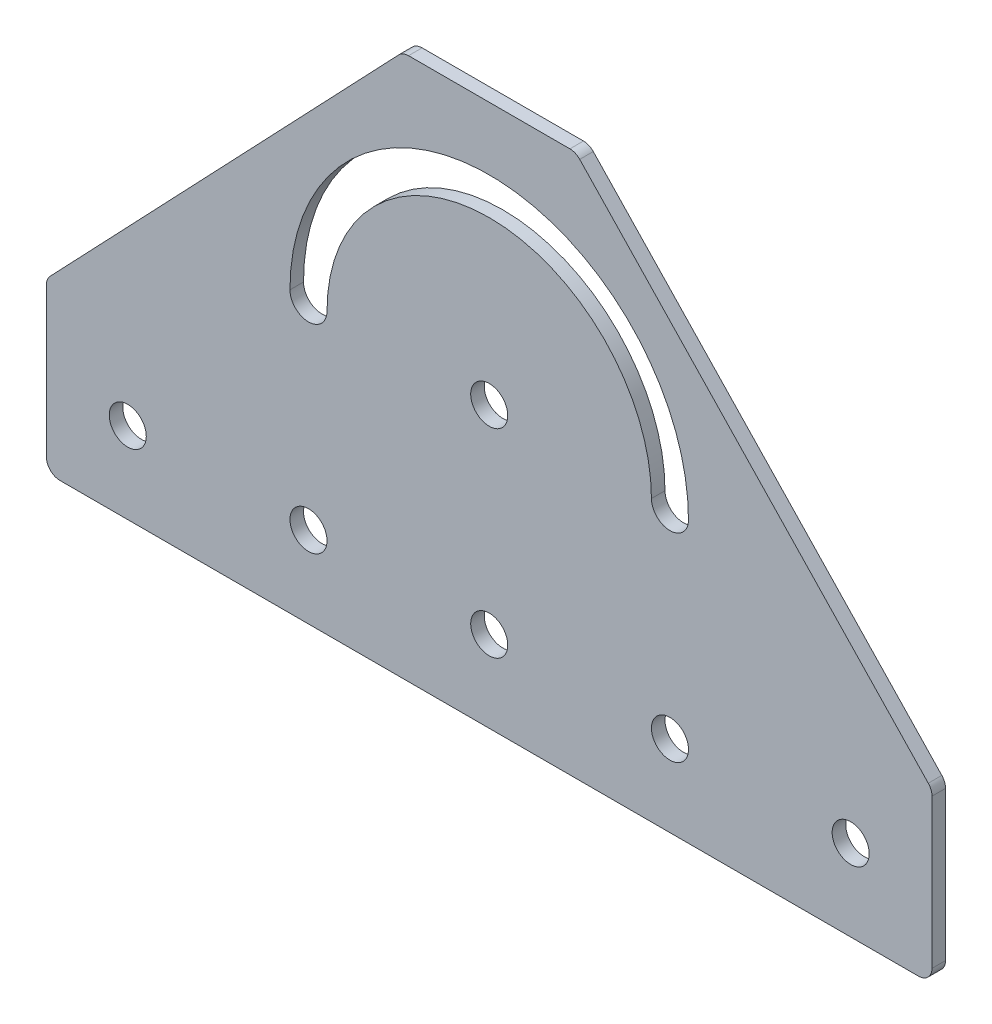
ISO-10303-21;
HEADER;
FILE_DESCRIPTION(('STEP AP214'),'2;1');
FILE_NAME('part.step','',(''),(''),'','','');
FILE_SCHEMA(('AUTOMOTIVE_DESIGN { 1 0 10303 214 1 1 1 1 }'));
ENDSEC;
DATA;
#1=APPLICATION_CONTEXT('core data for automotive mechanical design processes');
#2=APPLICATION_PROTOCOL_DEFINITION('international standard','automotive_design',2000,#1);
#3=PRODUCT_CONTEXT('',#1,'mechanical');
#4=PRODUCT('Part','Part','',(#3));
#5=PRODUCT_RELATED_PRODUCT_CATEGORY('part','',(#4));
#6=PRODUCT_DEFINITION_FORMATION('','',#4);
#7=PRODUCT_DEFINITION_CONTEXT('part definition',#1,'design');
#8=PRODUCT_DEFINITION('design','',#6,#7);
#9=PRODUCT_DEFINITION_SHAPE('','',#8);
#10=(LENGTH_UNIT() NAMED_UNIT(*) SI_UNIT(.MILLI.,.METRE.));
#11=(NAMED_UNIT(*) PLANE_ANGLE_UNIT() SI_UNIT($,.RADIAN.));
#12=(NAMED_UNIT(*) SI_UNIT($,.STERADIAN.) SOLID_ANGLE_UNIT());
#13=UNCERTAINTY_MEASURE_WITH_UNIT(LENGTH_MEASURE(1.E-05),#10,'distance_accuracy_value','');
#14=(GEOMETRIC_REPRESENTATION_CONTEXT(3) GLOBAL_UNCERTAINTY_ASSIGNED_CONTEXT((#13)) GLOBAL_UNIT_ASSIGNED_CONTEXT((#10,
#11,#12)) REPRESENTATION_CONTEXT('',''));
#15=CARTESIAN_POINT('',(0.,0.,0.));
#16=DIRECTION('',(0.,0.,1.));
#17=DIRECTION('',(1.,0.,0.));
#18=AXIS2_PLACEMENT_3D('',#15,#16,#17);
#19=CARTESIAN_POINT('',(0.,0.,3.));
#20=DIRECTION('',(0.,0.,1.));
#21=DIRECTION('',(1.,0.,0.));
#22=AXIS2_PLACEMENT_3D('',#19,#20,#21);
#23=PLANE('',#22);
#24=CARTESIAN_POINT('',(0.,63.9999999999994,3.));
#25=DIRECTION('',(0.,0.,1.));
#26=DIRECTION('',(1.,0.,0.));
#27=AXIS2_PLACEMENT_3D('',#24,#25,#26);
#28=CIRCLE('',#27,4.1);
#29=CARTESIAN_POINT('',(4.1,63.9999999999994,3.));
#30=VERTEX_POINT('',#29);
#31=EDGE_CURVE('E253',#30,#30,#28,.T.);
#32=ORIENTED_EDGE('',*,*,#31,.F.);
#33=EDGE_LOOP('',(#32));
#34=FACE_BOUND('',#33,.T.);
#35=CARTESIAN_POINT('',(-40.,19.9999999999992,3.));
#36=DIRECTION('',(0.,0.,1.));
#37=DIRECTION('',(1.,0.,0.));
#38=AXIS2_PLACEMENT_3D('',#35,#36,#37);
#39=CIRCLE('',#38,4.1);
#40=CARTESIAN_POINT('',(-35.9,19.9999999999992,3.));
#41=VERTEX_POINT('',#40);
#42=EDGE_CURVE('E267',#41,#41,#39,.T.);
#43=ORIENTED_EDGE('',*,*,#42,.F.);
#44=EDGE_LOOP('',(#43));
#45=FACE_BOUND('',#44,.T.);
#46=CARTESIAN_POINT('',(40.,19.9999999999997,3.));
#47=DIRECTION('',(0.,0.,1.));
#48=DIRECTION('',(1.,0.,0.));
#49=AXIS2_PLACEMENT_3D('',#46,#47,#48);
#50=CIRCLE('',#49,4.1);
#51=CARTESIAN_POINT('',(44.1,19.9999999999997,3.));
#52=VERTEX_POINT('',#51);
#53=EDGE_CURVE('E163',#52,#52,#50,.T.);
#54=ORIENTED_EDGE('',*,*,#53,.F.);
#55=EDGE_LOOP('',(#54));
#56=FACE_BOUND('',#55,.T.);
#57=CARTESIAN_POINT('',(80.,20.,3.));
#58=DIRECTION('',(0.,0.,1.));
#59=DIRECTION('',(1.,0.,0.));
#60=AXIS2_PLACEMENT_3D('',#57,#58,#59);
#61=CIRCLE('',#60,4.1);
#62=CARTESIAN_POINT('',(84.1,20.,3.));
#63=VERTEX_POINT('',#62);
#64=EDGE_CURVE('E174',#63,#63,#61,.T.);
#65=ORIENTED_EDGE('',*,*,#64,.F.);
#66=EDGE_LOOP('',(#65));
#67=FACE_BOUND('',#66,.T.);
#68=CARTESIAN_POINT('',(0.,63.9999999999994,3.));
#69=DIRECTION('',(0.,0.,1.));
#70=DIRECTION('',(1.,0.,0.));
#71=AXIS2_PLACEMENT_3D('',#68,#69,#70);
#72=CIRCLE('',#71,44.1);
#73=CARTESIAN_POINT('',(44.1,63.9999999999994,3.));
#74=VERTEX_POINT('',#73);
#75=CARTESIAN_POINT('',(-44.1,63.9999999999994,3.));
#76=VERTEX_POINT('',#75);
#77=EDGE_CURVE('E140',#74,#76,#72,.T.);
#78=ORIENTED_EDGE('',*,*,#77,.F.);
#79=CARTESIAN_POINT('',(40.,63.9999999999994,3.));
#80=DIRECTION('',(0.,0.,1.));
#81=DIRECTION('',(1.,0.,0.));
#82=AXIS2_PLACEMENT_3D('',#79,#80,#81);
#83=CIRCLE('',#82,4.1);
#84=CARTESIAN_POINT('',(35.9,63.9999999999994,3.));
#85=VERTEX_POINT('',#84);
#86=EDGE_CURVE('E130',#85,#74,#83,.T.);
#87=ORIENTED_EDGE('',*,*,#86,.F.);
#88=CARTESIAN_POINT('',(0.,63.9999999999994,3.));
#89=DIRECTION('',(0.,0.,-1.));
#90=DIRECTION('',(1.,0.,0.));
#91=AXIS2_PLACEMENT_3D('',#88,#89,#90);
#92=CIRCLE('',#91,35.9);
#93=CARTESIAN_POINT('',(-35.9,63.9999999999994,3.));
#94=VERTEX_POINT('',#93);
#95=EDGE_CURVE('E156',#94,#85,#92,.T.);
#96=ORIENTED_EDGE('',*,*,#95,.F.);
#97=CARTESIAN_POINT('',(-40.,63.9999999999994,3.));
#98=DIRECTION('',(0.,0.,1.));
#99=DIRECTION('',(1.,0.,0.));
#100=AXIS2_PLACEMENT_3D('',#97,#98,#99);
#101=CIRCLE('',#100,4.1);
#102=EDGE_CURVE('E154',#76,#94,#101,.T.);
#103=ORIENTED_EDGE('',*,*,#102,.F.);
#104=EDGE_LOOP('',(#78,#87,#96,#103));
#105=FACE_BOUND('',#104,.T.);
#106=CARTESIAN_POINT('',(0.,19.9999999999994,3.));
#107=DIRECTION('',(0.,0.,1.));
#108=DIRECTION('',(1.,0.,0.));
#109=AXIS2_PLACEMENT_3D('',#106,#107,#108);
#110=CIRCLE('',#109,4.1);
#111=CARTESIAN_POINT('',(4.1,19.9999999999994,3.));
#112=VERTEX_POINT('',#111);
#113=EDGE_CURVE('E273',#112,#112,#110,.T.);
#114=ORIENTED_EDGE('',*,*,#113,.F.);
#115=EDGE_LOOP('',(#114));
#116=FACE_BOUND('',#115,.T.);
#117=CARTESIAN_POINT('',(-80.,19.9999999999989,3.));
#118=DIRECTION('',(0.,0.,1.));
#119=DIRECTION('',(1.,0.,0.));
#120=AXIS2_PLACEMENT_3D('',#117,#118,#119);
#121=CIRCLE('',#120,4.1);
#122=CARTESIAN_POINT('',(-75.9,19.9999999999989,3.));
#123=VERTEX_POINT('',#122);
#124=EDGE_CURVE('E261',#123,#123,#121,.T.);
#125=ORIENTED_EDGE('',*,*,#124,.F.);
#126=EDGE_LOOP('',(#125));
#127=FACE_BOUND('',#126,.T.);
#128=DIRECTION('',(0.,1.,0.));
#129=VECTOR('',#128,1.);
#130=CARTESIAN_POINT('',(98.,2.00000000000001,3.));
#131=LINE('',#130,#129);
#132=CARTESIAN_POINT('',(98.,5.00000000000001,3.));
#133=VERTEX_POINT('',#132);
#134=CARTESIAN_POINT('',(98.,38.,3.));
#135=VERTEX_POINT('',#134);
#136=EDGE_CURVE('E243',#133,#135,#131,.T.);
#137=ORIENTED_EDGE('',*,*,#136,.T.);
#138=CARTESIAN_POINT('',(95.,38.,3.));
#139=DIRECTION('',(0.,0.,1.));
#140=DIRECTION('',(1.,0.,0.));
#141=AXIS2_PLACEMENT_3D('',#138,#139,#140);
#142=CIRCLE('',#141,3.);
#143=CARTESIAN_POINT('',(97.1724137931034,40.0689655172414,3.));
#144=VERTEX_POINT('',#143);
#145=EDGE_CURVE('E194',#135,#144,#142,.T.);
#146=ORIENTED_EDGE('',*,*,#145,.T.);
#147=DIRECTION('',(-0.689655172413796,0.72413793103448,0.));
#148=VECTOR('',#147,1.);
#149=CARTESIAN_POINT('',(98.,39.2,3.));
#150=LINE('',#149,#148);
#151=CARTESIAN_POINT('',(20.0295566502463,121.068965517241,3.));
#152=VERTEX_POINT('',#151);
#153=EDGE_CURVE('E239',#144,#152,#150,.T.);
#154=ORIENTED_EDGE('',*,*,#153,.T.);
#155=CARTESIAN_POINT('',(17.8571428571429,118.999999999999,3.));
#156=DIRECTION('',(0.,0.,1.));
#157=DIRECTION('',(1.,0.,0.));
#158=AXIS2_PLACEMENT_3D('',#155,#156,#157);
#159=CIRCLE('',#158,3.);
#160=CARTESIAN_POINT('',(17.8571428571429,121.999999999999,3.));
#161=VERTEX_POINT('',#160);
#162=EDGE_CURVE('E186',#152,#161,#159,.T.);
#163=ORIENTED_EDGE('',*,*,#162,.T.);
#164=DIRECTION('',(-1.,0.,0.));
#165=VECTOR('',#164,1.);
#166=CARTESIAN_POINT('',(19.1428571428571,121.999999999999,3.));
#167=LINE('',#166,#165);
#168=CARTESIAN_POINT('',(-17.8571428571429,121.999999999999,3.));
#169=VERTEX_POINT('',#168);
#170=EDGE_CURVE('E230',#161,#169,#167,.T.);
#171=ORIENTED_EDGE('',*,*,#170,.T.);
#172=CARTESIAN_POINT('',(-17.8571428571429,118.999999999999,3.));
#173=DIRECTION('',(0.,0.,1.));
#174=DIRECTION('',(1.,0.,0.));
#175=AXIS2_PLACEMENT_3D('',#172,#173,#174);
#176=CIRCLE('',#175,3.);
#177=CARTESIAN_POINT('',(-20.0295566502463,121.068965517241,3.));
#178=VERTEX_POINT('',#177);
#179=EDGE_CURVE('E184',#169,#178,#176,.T.);
#180=ORIENTED_EDGE('',*,*,#179,.T.);
#181=DIRECTION('',(-0.689655172413796,-0.72413793103448,0.));
#182=VECTOR('',#181,1.);
#183=CARTESIAN_POINT('',(-19.1428571428572,121.999999999999,3.));
#184=LINE('',#183,#182);
#185=CARTESIAN_POINT('',(-97.1724137931035,40.0689655172414,3.));
#186=VERTEX_POINT('',#185);
#187=EDGE_CURVE('E238',#178,#186,#184,.T.);
#188=ORIENTED_EDGE('',*,*,#187,.T.);
#189=CARTESIAN_POINT('',(-95.,38.,3.));
#190=DIRECTION('',(0.,0.,1.));
#191=DIRECTION('',(1.,0.,0.));
#192=AXIS2_PLACEMENT_3D('',#189,#190,#191);
#193=CIRCLE('',#192,3.);
#194=CARTESIAN_POINT('',(-98.,38.,3.));
#195=VERTEX_POINT('',#194);
#196=EDGE_CURVE('E188',#186,#195,#193,.T.);
#197=ORIENTED_EDGE('',*,*,#196,.T.);
#198=DIRECTION('',(0.,-1.,0.));
#199=VECTOR('',#198,1.);
#200=CARTESIAN_POINT('',(-98.,39.2,3.));
#201=LINE('',#200,#199);
#202=CARTESIAN_POINT('',(-98.,5.,3.));
#203=VERTEX_POINT('',#202);
#204=EDGE_CURVE('E241',#195,#203,#201,.T.);
#205=ORIENTED_EDGE('',*,*,#204,.T.);
#206=CARTESIAN_POINT('',(-95.,5.,3.));
#207=DIRECTION('',(0.,0.,1.));
#208=DIRECTION('',(1.,0.,0.));
#209=AXIS2_PLACEMENT_3D('',#206,#207,#208);
#210=CIRCLE('',#209,3.);
#211=CARTESIAN_POINT('',(-95.,2.,3.));
#212=VERTEX_POINT('',#211);
#213=EDGE_CURVE('E190',#203,#212,#210,.T.);
#214=ORIENTED_EDGE('',*,*,#213,.T.);
#215=DIRECTION('',(1.,0.,0.));
#216=VECTOR('',#215,1.);
#217=CARTESIAN_POINT('',(-98.,2.,3.));
#218=LINE('',#217,#216);
#219=CARTESIAN_POINT('',(95.,2.00000000000001,3.));
#220=VERTEX_POINT('',#219);
#221=EDGE_CURVE('E249',#212,#220,#218,.T.);
#222=ORIENTED_EDGE('',*,*,#221,.T.);
#223=CARTESIAN_POINT('',(95.,5.00000000000001,3.));
#224=DIRECTION('',(0.,0.,1.));
#225=DIRECTION('',(1.,0.,0.));
#226=AXIS2_PLACEMENT_3D('',#223,#224,#225);
#227=CIRCLE('',#226,3.);
#228=EDGE_CURVE('E192',#220,#133,#227,.T.);
#229=ORIENTED_EDGE('',*,*,#228,.T.);
#230=EDGE_LOOP('',(#137,#146,#154,#163,#171,#180,#188,#197,#205,#214,#222,#229));
#231=FACE_BOUND('',#230,.T.);
#232=ADVANCED_FACE('F16',(#34,#45,#56,#67,#105,#116,#127,#231),#23,.T.);
#233=CARTESIAN_POINT('',(0.,0.,0.));
#234=DIRECTION('',(0.,0.,1.));
#235=DIRECTION('',(1.,0.,0.));
#236=AXIS2_PLACEMENT_3D('',#233,#234,#235);
#237=PLANE('',#236);
#238=CARTESIAN_POINT('',(0.,63.9999999999994,0.));
#239=DIRECTION('',(0.,0.,1.));
#240=DIRECTION('',(1.,0.,0.));
#241=AXIS2_PLACEMENT_3D('',#238,#239,#240);
#242=CIRCLE('',#241,4.1);
#243=CARTESIAN_POINT('',(4.1,63.9999999999994,0.));
#244=VERTEX_POINT('',#243);
#245=EDGE_CURVE('E257',#244,#244,#242,.T.);
#246=ORIENTED_EDGE('',*,*,#245,.T.);
#247=EDGE_LOOP('',(#246));
#248=FACE_BOUND('',#247,.T.);
#249=CARTESIAN_POINT('',(-80.,19.9999999999989,0.));
#250=DIRECTION('',(0.,0.,1.));
#251=DIRECTION('',(1.,0.,0.));
#252=AXIS2_PLACEMENT_3D('',#249,#250,#251);
#253=CIRCLE('',#252,4.1);
#254=CARTESIAN_POINT('',(-75.9,19.9999999999989,0.));
#255=VERTEX_POINT('',#254);
#256=EDGE_CURVE('E256',#255,#255,#253,.T.);
#257=ORIENTED_EDGE('',*,*,#256,.T.);
#258=EDGE_LOOP('',(#257));
#259=FACE_BOUND('',#258,.T.);
#260=CARTESIAN_POINT('',(-40.,19.9999999999992,0.));
#261=DIRECTION('',(0.,0.,1.));
#262=DIRECTION('',(1.,0.,0.));
#263=AXIS2_PLACEMENT_3D('',#260,#261,#262);
#264=CIRCLE('',#263,4.1);
#265=CARTESIAN_POINT('',(-35.9,19.9999999999992,0.));
#266=VERTEX_POINT('',#265);
#267=EDGE_CURVE('E264',#266,#266,#264,.T.);
#268=ORIENTED_EDGE('',*,*,#267,.T.);
#269=EDGE_LOOP('',(#268));
#270=FACE_BOUND('',#269,.T.);
#271=CARTESIAN_POINT('',(0.,19.9999999999994,0.));
#272=DIRECTION('',(0.,0.,1.));
#273=DIRECTION('',(1.,0.,0.));
#274=AXIS2_PLACEMENT_3D('',#271,#272,#273);
#275=CIRCLE('',#274,4.1);
#276=CARTESIAN_POINT('',(4.1,19.9999999999994,0.));
#277=VERTEX_POINT('',#276);
#278=EDGE_CURVE('E270',#277,#277,#275,.T.);
#279=ORIENTED_EDGE('',*,*,#278,.T.);
#280=EDGE_LOOP('',(#279));
#281=FACE_BOUND('',#280,.T.);
#282=CARTESIAN_POINT('',(40.,19.9999999999997,0.));
#283=DIRECTION('',(0.,0.,1.));
#284=DIRECTION('',(1.,0.,0.));
#285=AXIS2_PLACEMENT_3D('',#282,#283,#284);
#286=CIRCLE('',#285,4.1);
#287=CARTESIAN_POINT('',(44.1,19.9999999999997,0.));
#288=VERTEX_POINT('',#287);
#289=EDGE_CURVE('E276',#288,#288,#286,.T.);
#290=ORIENTED_EDGE('',*,*,#289,.T.);
#291=EDGE_LOOP('',(#290));
#292=FACE_BOUND('',#291,.T.);
#293=CARTESIAN_POINT('',(40.,63.9999999999994,0.));
#294=DIRECTION('',(0.,0.,1.));
#295=DIRECTION('',(1.,0.,0.));
#296=AXIS2_PLACEMENT_3D('',#293,#294,#295);
#297=CIRCLE('',#296,4.1);
#298=CARTESIAN_POINT('',(35.9,63.9999999999994,0.));
#299=VERTEX_POINT('',#298);
#300=CARTESIAN_POINT('',(44.1,63.9999999999994,0.));
#301=VERTEX_POINT('',#300);
#302=EDGE_CURVE('E161',#299,#301,#297,.T.);
#303=ORIENTED_EDGE('',*,*,#302,.T.);
#304=CARTESIAN_POINT('',(0.,63.9999999999994,0.));
#305=DIRECTION('',(0.,0.,1.));
#306=DIRECTION('',(1.,0.,0.));
#307=AXIS2_PLACEMENT_3D('',#304,#305,#306);
#308=CIRCLE('',#307,44.1);
#309=CARTESIAN_POINT('',(-44.1,63.9999999999994,0.));
#310=VERTEX_POINT('',#309);
#311=EDGE_CURVE('E147',#301,#310,#308,.T.);
#312=ORIENTED_EDGE('',*,*,#311,.T.);
#313=CARTESIAN_POINT('',(-40.,63.9999999999994,0.));
#314=DIRECTION('',(0.,0.,1.));
#315=DIRECTION('',(1.,0.,0.));
#316=AXIS2_PLACEMENT_3D('',#313,#314,#315);
#317=CIRCLE('',#316,4.1);
#318=CARTESIAN_POINT('',(-35.9,63.9999999999994,0.));
#319=VERTEX_POINT('',#318);
#320=EDGE_CURVE('E165',#310,#319,#317,.T.);
#321=ORIENTED_EDGE('',*,*,#320,.T.);
#322=CARTESIAN_POINT('',(0.,63.9999999999994,0.));
#323=DIRECTION('',(0.,0.,-1.));
#324=DIRECTION('',(1.,0.,0.));
#325=AXIS2_PLACEMENT_3D('',#322,#323,#324);
#326=CIRCLE('',#325,35.9);
#327=EDGE_CURVE('E141',#319,#299,#326,.T.);
#328=ORIENTED_EDGE('',*,*,#327,.T.);
#329=EDGE_LOOP('',(#303,#312,#321,#328));
#330=FACE_BOUND('',#329,.T.);
#331=CARTESIAN_POINT('',(80.,20.,0.));
#332=DIRECTION('',(0.,0.,1.));
#333=DIRECTION('',(1.,0.,0.));
#334=AXIS2_PLACEMENT_3D('',#331,#332,#333);
#335=CIRCLE('',#334,4.1);
#336=CARTESIAN_POINT('',(84.1,20.,0.));
#337=VERTEX_POINT('',#336);
#338=EDGE_CURVE('E148',#337,#337,#335,.T.);
#339=ORIENTED_EDGE('',*,*,#338,.T.);
#340=EDGE_LOOP('',(#339));
#341=FACE_BOUND('',#340,.T.);
#342=DIRECTION('',(-0.689655172413796,0.72413793103448,0.));
#343=VECTOR('',#342,1.);
#344=CARTESIAN_POINT('',(98.,39.2,0.));
#345=LINE('',#344,#343);
#346=CARTESIAN_POINT('',(97.1724137931034,40.0689655172414,0.));
#347=VERTEX_POINT('',#346);
#348=CARTESIAN_POINT('',(20.0295566502463,121.068965517241,0.));
#349=VERTEX_POINT('',#348);
#350=EDGE_CURVE('E343',#347,#349,#345,.T.);
#351=ORIENTED_EDGE('',*,*,#350,.F.);
#352=CARTESIAN_POINT('',(95.,38.,0.));
#353=DIRECTION('',(0.,0.,1.));
#354=DIRECTION('',(1.,0.,0.));
#355=AXIS2_PLACEMENT_3D('',#352,#353,#354);
#356=CIRCLE('',#355,3.);
#357=CARTESIAN_POINT('',(98.,38.,0.));
#358=VERTEX_POINT('',#357);
#359=EDGE_CURVE('E210',#347,#358,#356,.F.);
#360=ORIENTED_EDGE('',*,*,#359,.T.);
#361=DIRECTION('',(0.,1.,0.));
#362=VECTOR('',#361,1.);
#363=CARTESIAN_POINT('',(98.,2.00000000000001,0.));
#364=LINE('',#363,#362);
#365=CARTESIAN_POINT('',(98.,5.00000000000001,0.));
#366=VERTEX_POINT('',#365);
#367=EDGE_CURVE('E252',#366,#358,#364,.T.);
#368=ORIENTED_EDGE('',*,*,#367,.F.);
#369=CARTESIAN_POINT('',(95.,5.00000000000001,0.));
#370=DIRECTION('',(0.,0.,1.));
#371=DIRECTION('',(1.,0.,0.));
#372=AXIS2_PLACEMENT_3D('',#369,#370,#371);
#373=CIRCLE('',#372,3.);
#374=CARTESIAN_POINT('',(95.,2.00000000000001,0.));
#375=VERTEX_POINT('',#374);
#376=EDGE_CURVE('E208',#366,#375,#373,.F.);
#377=ORIENTED_EDGE('',*,*,#376,.T.);
#378=DIRECTION('',(1.,0.,0.));
#379=VECTOR('',#378,1.);
#380=CARTESIAN_POINT('',(-98.,2.,0.));
#381=LINE('',#380,#379);
#382=CARTESIAN_POINT('',(-95.,2.,0.));
#383=VERTEX_POINT('',#382);
#384=EDGE_CURVE('E260',#383,#375,#381,.T.);
#385=ORIENTED_EDGE('',*,*,#384,.F.);
#386=CARTESIAN_POINT('',(-95.,5.,0.));
#387=DIRECTION('',(0.,0.,1.));
#388=DIRECTION('',(1.,0.,0.));
#389=AXIS2_PLACEMENT_3D('',#386,#387,#388);
#390=CIRCLE('',#389,3.);
#391=CARTESIAN_POINT('',(-98.,5.,0.));
#392=VERTEX_POINT('',#391);
#393=EDGE_CURVE('E206',#383,#392,#390,.F.);
#394=ORIENTED_EDGE('',*,*,#393,.T.);
#395=DIRECTION('',(0.,-1.,0.));
#396=VECTOR('',#395,1.);
#397=CARTESIAN_POINT('',(-98.,39.2,0.));
#398=LINE('',#397,#396);
#399=CARTESIAN_POINT('',(-98.,38.,0.));
#400=VERTEX_POINT('',#399);
#401=EDGE_CURVE('E356',#400,#392,#398,.T.);
#402=ORIENTED_EDGE('',*,*,#401,.F.);
#403=CARTESIAN_POINT('',(-95.,38.,0.));
#404=DIRECTION('',(0.,0.,1.));
#405=DIRECTION('',(1.,0.,0.));
#406=AXIS2_PLACEMENT_3D('',#403,#404,#405);
#407=CIRCLE('',#406,3.);
#408=CARTESIAN_POINT('',(-97.1724137931035,40.0689655172414,0.));
#409=VERTEX_POINT('',#408);
#410=EDGE_CURVE('E204',#400,#409,#407,.F.);
#411=ORIENTED_EDGE('',*,*,#410,.T.);
#412=DIRECTION('',(-0.689655172413796,-0.72413793103448,0.));
#413=VECTOR('',#412,1.);
#414=CARTESIAN_POINT('',(-19.1428571428572,121.999999999999,0.));
#415=LINE('',#414,#413);
#416=CARTESIAN_POINT('',(-20.0295566502463,121.068965517241,0.));
#417=VERTEX_POINT('',#416);
#418=EDGE_CURVE('E349',#417,#409,#415,.T.);
#419=ORIENTED_EDGE('',*,*,#418,.F.);
#420=CARTESIAN_POINT('',(-17.8571428571429,118.999999999999,0.));
#421=DIRECTION('',(0.,0.,1.));
#422=DIRECTION('',(1.,0.,0.));
#423=AXIS2_PLACEMENT_3D('',#420,#421,#422);
#424=CIRCLE('',#423,3.);
#425=CARTESIAN_POINT('',(-17.8571428571429,121.999999999999,0.));
#426=VERTEX_POINT('',#425);
#427=EDGE_CURVE('E31',#417,#426,#424,.F.);
#428=ORIENTED_EDGE('',*,*,#427,.T.);
#429=DIRECTION('',(-1.,0.,0.));
#430=VECTOR('',#429,1.);
#431=CARTESIAN_POINT('',(19.1428571428571,121.999999999999,0.));
#432=LINE('',#431,#430);
#433=CARTESIAN_POINT('',(17.8571428571429,121.999999999999,0.));
#434=VERTEX_POINT('',#433);
#435=EDGE_CURVE('E231',#434,#426,#432,.T.);
#436=ORIENTED_EDGE('',*,*,#435,.F.);
#437=CARTESIAN_POINT('',(17.8571428571429,118.999999999999,0.));
#438=DIRECTION('',(0.,0.,1.));
#439=DIRECTION('',(1.,0.,0.));
#440=AXIS2_PLACEMENT_3D('',#437,#438,#439);
#441=CIRCLE('',#440,3.);
#442=EDGE_CURVE('E202',#434,#349,#441,.F.);
#443=ORIENTED_EDGE('',*,*,#442,.T.);
#444=EDGE_LOOP('',(#351,#360,#368,#377,#385,#394,#402,#411,#419,#428,#436,#443));
#445=FACE_BOUND('',#444,.T.);
#446=ADVANCED_FACE('F283',(#248,#259,#270,#281,#292,#330,#341,#445),#237,.F.);
#447=CARTESIAN_POINT('',(80.,20.,3.));
#448=DIRECTION('',(0.,0.,-1.));
#449=DIRECTION('',(-1.,0.,0.));
#450=AXIS2_PLACEMENT_3D('',#447,#448,#449);
#451=CYLINDRICAL_SURFACE('',#450,4.1);
#452=ORIENTED_EDGE('',*,*,#64,.T.);
#453=EDGE_LOOP('',(#452));
#454=FACE_BOUND('',#453,.T.);
#455=ORIENTED_EDGE('',*,*,#338,.F.);
#456=EDGE_LOOP('',(#455));
#457=FACE_BOUND('',#456,.T.);
#458=ADVANCED_FACE('F309',(#454,#457),#451,.F.);
#459=CARTESIAN_POINT('',(40.,63.9999999999994,3.));
#460=DIRECTION('',(0.,0.,-1.));
#461=DIRECTION('',(-1.,0.,0.));
#462=AXIS2_PLACEMENT_3D('',#459,#460,#461);
#463=CYLINDRICAL_SURFACE('',#462,4.1);
#464=ORIENTED_EDGE('',*,*,#302,.F.);
#465=DIRECTION('',(0.,0.,-1.));
#466=VECTOR('',#465,1.);
#467=CARTESIAN_POINT('',(35.9,63.9999999999994,3.));
#468=LINE('',#467,#466);
#469=EDGE_CURVE('E136',#85,#299,#468,.T.);
#470=ORIENTED_EDGE('',*,*,#469,.F.);
#471=ORIENTED_EDGE('',*,*,#86,.T.);
#472=DIRECTION('',(0.,0.,-1.));
#473=VECTOR('',#472,1.);
#474=CARTESIAN_POINT('',(44.1,63.9999999999994,3.));
#475=LINE('',#474,#473);
#476=EDGE_CURVE('E133',#74,#301,#475,.T.);
#477=ORIENTED_EDGE('',*,*,#476,.T.);
#478=EDGE_LOOP('',(#464,#470,#471,#477));
#479=FACE_BOUND('',#478,.T.);
#480=ADVANCED_FACE('F132',(#479),#463,.F.);
#481=CARTESIAN_POINT('',(0.,63.9999999999994,3.));
#482=DIRECTION('',(0.,0.,-1.));
#483=DIRECTION('',(-1.,0.,0.));
#484=AXIS2_PLACEMENT_3D('',#481,#482,#483);
#485=CYLINDRICAL_SURFACE('',#484,44.1);
#486=ORIENTED_EDGE('',*,*,#311,.F.);
#487=ORIENTED_EDGE('',*,*,#476,.F.);
#488=ORIENTED_EDGE('',*,*,#77,.T.);
#489=DIRECTION('',(0.,0.,-1.));
#490=VECTOR('',#489,1.);
#491=CARTESIAN_POINT('',(-44.1,63.9999999999994,3.));
#492=LINE('',#491,#490);
#493=EDGE_CURVE('E149',#76,#310,#492,.T.);
#494=ORIENTED_EDGE('',*,*,#493,.T.);
#495=EDGE_LOOP('',(#486,#487,#488,#494));
#496=FACE_BOUND('',#495,.T.);
#497=ADVANCED_FACE('F144',(#496),#485,.F.);
#498=CARTESIAN_POINT('',(-40.,63.9999999999994,3.));
#499=DIRECTION('',(0.,0.,-1.));
#500=DIRECTION('',(-1.,0.,0.));
#501=AXIS2_PLACEMENT_3D('',#498,#499,#500);
#502=CYLINDRICAL_SURFACE('',#501,4.1);
#503=ORIENTED_EDGE('',*,*,#320,.F.);
#504=ORIENTED_EDGE('',*,*,#493,.F.);
#505=ORIENTED_EDGE('',*,*,#102,.T.);
#506=DIRECTION('',(0.,0.,-1.));
#507=VECTOR('',#506,1.);
#508=CARTESIAN_POINT('',(-35.9,63.9999999999994,3.));
#509=LINE('',#508,#507);
#510=EDGE_CURVE('E171',#94,#319,#509,.T.);
#511=ORIENTED_EDGE('',*,*,#510,.T.);
#512=EDGE_LOOP('',(#503,#504,#505,#511));
#513=FACE_BOUND('',#512,.T.);
#514=ADVANCED_FACE('F300',(#513),#502,.F.);
#515=CARTESIAN_POINT('',(0.,63.9999999999994,3.));
#516=DIRECTION('',(0.,0.,-1.));
#517=DIRECTION('',(-1.,0.,0.));
#518=AXIS2_PLACEMENT_3D('',#515,#516,#517);
#519=CYLINDRICAL_SURFACE('',#518,35.9);
#520=ORIENTED_EDGE('',*,*,#327,.F.);
#521=ORIENTED_EDGE('',*,*,#510,.F.);
#522=ORIENTED_EDGE('',*,*,#95,.T.);
#523=ORIENTED_EDGE('',*,*,#469,.T.);
#524=EDGE_LOOP('',(#520,#521,#522,#523));
#525=FACE_BOUND('',#524,.T.);
#526=ADVANCED_FACE('F289',(#525),#519,.T.);
#527=CARTESIAN_POINT('',(40.,19.9999999999997,3.));
#528=DIRECTION('',(0.,0.,-1.));
#529=DIRECTION('',(-1.,0.,0.));
#530=AXIS2_PLACEMENT_3D('',#527,#528,#529);
#531=CYLINDRICAL_SURFACE('',#530,4.1);
#532=ORIENTED_EDGE('',*,*,#53,.T.);
#533=EDGE_LOOP('',(#532));
#534=FACE_BOUND('',#533,.T.);
#535=ORIENTED_EDGE('',*,*,#289,.F.);
#536=EDGE_LOOP('',(#535));
#537=FACE_BOUND('',#536,.T.);
#538=ADVANCED_FACE('F286',(#534,#537),#531,.F.);
#539=CARTESIAN_POINT('',(0.,19.9999999999994,3.));
#540=DIRECTION('',(0.,0.,-1.));
#541=DIRECTION('',(-1.,0.,0.));
#542=AXIS2_PLACEMENT_3D('',#539,#540,#541);
#543=CYLINDRICAL_SURFACE('',#542,4.1);
#544=ORIENTED_EDGE('',*,*,#113,.T.);
#545=EDGE_LOOP('',(#544));
#546=FACE_BOUND('',#545,.T.);
#547=ORIENTED_EDGE('',*,*,#278,.F.);
#548=EDGE_LOOP('',(#547));
#549=FACE_BOUND('',#548,.T.);
#550=ADVANCED_FACE('F288',(#546,#549),#543,.F.);
#551=CARTESIAN_POINT('',(-40.,19.9999999999992,3.));
#552=DIRECTION('',(0.,0.,-1.));
#553=DIRECTION('',(-1.,0.,0.));
#554=AXIS2_PLACEMENT_3D('',#551,#552,#553);
#555=CYLINDRICAL_SURFACE('',#554,4.1);
#556=ORIENTED_EDGE('',*,*,#42,.T.);
#557=EDGE_LOOP('',(#556));
#558=FACE_BOUND('',#557,.T.);
#559=ORIENTED_EDGE('',*,*,#267,.F.);
#560=EDGE_LOOP('',(#559));
#561=FACE_BOUND('',#560,.T.);
#562=ADVANCED_FACE('F297',(#558,#561),#555,.F.);
#563=CARTESIAN_POINT('',(-80.,19.9999999999989,3.));
#564=DIRECTION('',(0.,0.,-1.));
#565=DIRECTION('',(-1.,0.,0.));
#566=AXIS2_PLACEMENT_3D('',#563,#564,#565);
#567=CYLINDRICAL_SURFACE('',#566,4.1);
#568=ORIENTED_EDGE('',*,*,#124,.T.);
#569=EDGE_LOOP('',(#568));
#570=FACE_BOUND('',#569,.T.);
#571=ORIENTED_EDGE('',*,*,#256,.F.);
#572=EDGE_LOOP('',(#571));
#573=FACE_BOUND('',#572,.T.);
#574=ADVANCED_FACE('F402',(#570,#573),#567,.F.);
#575=CARTESIAN_POINT('',(0.,63.9999999999994,3.));
#576=DIRECTION('',(0.,0.,-1.));
#577=DIRECTION('',(-1.,0.,0.));
#578=AXIS2_PLACEMENT_3D('',#575,#576,#577);
#579=CYLINDRICAL_SURFACE('',#578,4.1);
#580=ORIENTED_EDGE('',*,*,#31,.T.);
#581=EDGE_LOOP('',(#580));
#582=FACE_BOUND('',#581,.T.);
#583=ORIENTED_EDGE('',*,*,#245,.F.);
#584=EDGE_LOOP('',(#583));
#585=FACE_BOUND('',#584,.T.);
#586=ADVANCED_FACE('F399',(#582,#585),#579,.F.);
#587=CARTESIAN_POINT('',(98.,2.00000000000001,0.));
#588=DIRECTION('',(1.,0.,0.));
#589=DIRECTION('',(0.,0.,-1.));
#590=AXIS2_PLACEMENT_3D('',#587,#588,#589);
#591=PLANE('',#590);
#592=ORIENTED_EDGE('',*,*,#367,.T.);
#593=DIRECTION('',(0.,0.,1.));
#594=VECTOR('',#593,1.);
#595=CARTESIAN_POINT('',(98.,38.,0.));
#596=LINE('',#595,#594);
#597=EDGE_CURVE('E181',#358,#135,#596,.T.);
#598=ORIENTED_EDGE('',*,*,#597,.T.);
#599=ORIENTED_EDGE('',*,*,#136,.F.);
#600=DIRECTION('',(0.,0.,1.));
#601=VECTOR('',#600,1.);
#602=CARTESIAN_POINT('',(98.,5.00000000000001,0.));
#603=LINE('',#602,#601);
#604=EDGE_CURVE('E177',#133,#366,#603,.F.);
#605=ORIENTED_EDGE('',*,*,#604,.T.);
#606=EDGE_LOOP('',(#592,#598,#599,#605));
#607=FACE_BOUND('',#606,.T.);
#608=ADVANCED_FACE('F363',(#607),#591,.T.);
#609=CARTESIAN_POINT('',(-98.,2.,0.));
#610=DIRECTION('',(0.,-1.,0.));
#611=DIRECTION('',(1.,0.,0.));
#612=AXIS2_PLACEMENT_3D('',#609,#610,#611);
#613=PLANE('',#612);
#614=ORIENTED_EDGE('',*,*,#384,.T.);
#615=DIRECTION('',(0.,0.,1.));
#616=VECTOR('',#615,1.);
#617=CARTESIAN_POINT('',(95.,2.00000000000001,0.));
#618=LINE('',#617,#616);
#619=EDGE_CURVE('E214',#375,#220,#618,.T.);
#620=ORIENTED_EDGE('',*,*,#619,.T.);
#621=ORIENTED_EDGE('',*,*,#221,.F.);
#622=DIRECTION('',(0.,0.,1.));
#623=VECTOR('',#622,1.);
#624=CARTESIAN_POINT('',(-95.,2.,0.));
#625=LINE('',#624,#623);
#626=EDGE_CURVE('E212',#212,#383,#625,.F.);
#627=ORIENTED_EDGE('',*,*,#626,.T.);
#628=EDGE_LOOP('',(#614,#620,#621,#627));
#629=FACE_BOUND('',#628,.T.);
#630=ADVANCED_FACE('F371',(#629),#613,.T.);
#631=CARTESIAN_POINT('',(-98.,39.2,0.));
#632=DIRECTION('',(-1.,0.,0.));
#633=DIRECTION('',(0.,0.,1.));
#634=AXIS2_PLACEMENT_3D('',#631,#632,#633);
#635=PLANE('',#634);
#636=ORIENTED_EDGE('',*,*,#401,.T.);
#637=DIRECTION('',(0.,0.,1.));
#638=VECTOR('',#637,1.);
#639=CARTESIAN_POINT('',(-98.,5.,0.));
#640=LINE('',#639,#638);
#641=EDGE_CURVE('E219',#392,#203,#640,.T.);
#642=ORIENTED_EDGE('',*,*,#641,.T.);
#643=ORIENTED_EDGE('',*,*,#204,.F.);
#644=DIRECTION('',(0.,0.,1.));
#645=VECTOR('',#644,1.);
#646=CARTESIAN_POINT('',(-98.,38.,0.));
#647=LINE('',#646,#645);
#648=EDGE_CURVE('E217',#195,#400,#647,.F.);
#649=ORIENTED_EDGE('',*,*,#648,.T.);
#650=EDGE_LOOP('',(#636,#642,#643,#649));
#651=FACE_BOUND('',#650,.T.);
#652=ADVANCED_FACE('F378',(#651),#635,.T.);
#653=CARTESIAN_POINT('',(-19.1428571428572,121.999999999999,0.));
#654=DIRECTION('',(-0.72413793103448,0.689655172413796,0.));
#655=DIRECTION('',(-0.689655172413796,-0.72413793103448,0.));
#656=AXIS2_PLACEMENT_3D('',#653,#654,#655);
#657=PLANE('',#656);
#658=ORIENTED_EDGE('',*,*,#418,.T.);
#659=DIRECTION('',(0.,0.,1.));
#660=VECTOR('',#659,1.);
#661=CARTESIAN_POINT('',(-97.1724137931034,40.0689655172414,0.));
#662=LINE('',#661,#660);
#663=EDGE_CURVE('E224',#409,#186,#662,.T.);
#664=ORIENTED_EDGE('',*,*,#663,.T.);
#665=ORIENTED_EDGE('',*,*,#187,.F.);
#666=DIRECTION('',(0.,0.,1.));
#667=VECTOR('',#666,1.);
#668=CARTESIAN_POINT('',(-20.0295566502463,121.068965517241,0.));
#669=LINE('',#668,#667);
#670=EDGE_CURVE('E222',#178,#417,#669,.F.);
#671=ORIENTED_EDGE('',*,*,#670,.T.);
#672=EDGE_LOOP('',(#658,#664,#665,#671));
#673=FACE_BOUND('',#672,.T.);
#674=ADVANCED_FACE('F383',(#673),#657,.T.);
#675=CARTESIAN_POINT('',(19.1428571428571,121.999999999999,0.));
#676=DIRECTION('',(0.,1.,0.));
#677=DIRECTION('',(0.,0.,1.));
#678=AXIS2_PLACEMENT_3D('',#675,#676,#677);
#679=PLANE('',#678);
#680=ORIENTED_EDGE('',*,*,#170,.F.);
#681=DIRECTION('',(0.,0.,1.));
#682=VECTOR('',#681,1.);
#683=CARTESIAN_POINT('',(17.8571428571429,121.999999999999,0.));
#684=LINE('',#683,#682);
#685=EDGE_CURVE('E10',#161,#434,#684,.F.);
#686=ORIENTED_EDGE('',*,*,#685,.T.);
#687=ORIENTED_EDGE('',*,*,#435,.T.);
#688=DIRECTION('',(0.,0.,1.));
#689=VECTOR('',#688,1.);
#690=CARTESIAN_POINT('',(-17.8571428571429,121.999999999999,0.));
#691=LINE('',#690,#689);
#692=EDGE_CURVE('E24',#426,#169,#691,.T.);
#693=ORIENTED_EDGE('',*,*,#692,.T.);
#694=EDGE_LOOP('',(#680,#686,#687,#693));
#695=FACE_BOUND('',#694,.T.);
#696=ADVANCED_FACE('F229',(#695),#679,.T.);
#697=CARTESIAN_POINT('',(98.,39.2,0.));
#698=DIRECTION('',(0.72413793103448,0.689655172413796,0.));
#699=DIRECTION('',(-0.689655172413796,0.72413793103448,0.));
#700=AXIS2_PLACEMENT_3D('',#697,#698,#699);
#701=PLANE('',#700);
#702=ORIENTED_EDGE('',*,*,#153,.F.);
#703=DIRECTION('',(0.,0.,1.));
#704=VECTOR('',#703,1.);
#705=CARTESIAN_POINT('',(97.1724137931034,40.0689655172414,0.));
#706=LINE('',#705,#704);
#707=EDGE_CURVE('E199',#144,#347,#706,.F.);
#708=ORIENTED_EDGE('',*,*,#707,.T.);
#709=ORIENTED_EDGE('',*,*,#350,.T.);
#710=DIRECTION('',(0.,0.,1.));
#711=VECTOR('',#710,1.);
#712=CARTESIAN_POINT('',(20.0295566502463,121.068965517241,0.));
#713=LINE('',#712,#711);
#714=EDGE_CURVE('E196',#349,#152,#713,.T.);
#715=ORIENTED_EDGE('',*,*,#714,.T.);
#716=EDGE_LOOP('',(#702,#708,#709,#715));
#717=FACE_BOUND('',#716,.T.);
#718=ADVANCED_FACE('F321',(#717),#701,.T.);
#719=CARTESIAN_POINT('',(95.,38.,0.));
#720=DIRECTION('',(0.,0.,1.));
#721=DIRECTION('',(1.,0.,0.));
#722=AXIS2_PLACEMENT_3D('',#719,#720,#721);
#723=CYLINDRICAL_SURFACE('',#722,3.);
#724=ORIENTED_EDGE('',*,*,#359,.F.);
#725=ORIENTED_EDGE('',*,*,#707,.F.);
#726=ORIENTED_EDGE('',*,*,#145,.F.);
#727=ORIENTED_EDGE('',*,*,#597,.F.);
#728=EDGE_LOOP('',(#724,#725,#726,#727));
#729=FACE_BOUND('',#728,.T.);
#730=ADVANCED_FACE('F317',(#729),#723,.T.);
#731=CARTESIAN_POINT('',(95.,5.00000000000001,0.));
#732=DIRECTION('',(0.,0.,1.));
#733=DIRECTION('',(1.,0.,0.));
#734=AXIS2_PLACEMENT_3D('',#731,#732,#733);
#735=CYLINDRICAL_SURFACE('',#734,3.);
#736=ORIENTED_EDGE('',*,*,#376,.F.);
#737=ORIENTED_EDGE('',*,*,#604,.F.);
#738=ORIENTED_EDGE('',*,*,#228,.F.);
#739=ORIENTED_EDGE('',*,*,#619,.F.);
#740=EDGE_LOOP('',(#736,#737,#738,#739));
#741=FACE_BOUND('',#740,.T.);
#742=ADVANCED_FACE('F320',(#741),#735,.T.);
#743=CARTESIAN_POINT('',(-95.,5.,0.));
#744=DIRECTION('',(0.,0.,1.));
#745=DIRECTION('',(1.,0.,0.));
#746=AXIS2_PLACEMENT_3D('',#743,#744,#745);
#747=CYLINDRICAL_SURFACE('',#746,3.);
#748=ORIENTED_EDGE('',*,*,#393,.F.);
#749=ORIENTED_EDGE('',*,*,#626,.F.);
#750=ORIENTED_EDGE('',*,*,#213,.F.);
#751=ORIENTED_EDGE('',*,*,#641,.F.);
#752=EDGE_LOOP('',(#748,#749,#750,#751));
#753=FACE_BOUND('',#752,.T.);
#754=ADVANCED_FACE('F325',(#753),#747,.T.);
#755=CARTESIAN_POINT('',(-95.,38.,0.));
#756=DIRECTION('',(0.,0.,1.));
#757=DIRECTION('',(1.,0.,0.));
#758=AXIS2_PLACEMENT_3D('',#755,#756,#757);
#759=CYLINDRICAL_SURFACE('',#758,3.);
#760=ORIENTED_EDGE('',*,*,#410,.F.);
#761=ORIENTED_EDGE('',*,*,#648,.F.);
#762=ORIENTED_EDGE('',*,*,#196,.F.);
#763=ORIENTED_EDGE('',*,*,#663,.F.);
#764=EDGE_LOOP('',(#760,#761,#762,#763));
#765=FACE_BOUND('',#764,.T.);
#766=ADVANCED_FACE('F329',(#765),#759,.T.);
#767=CARTESIAN_POINT('',(17.8571428571429,118.999999999999,0.));
#768=DIRECTION('',(0.,0.,1.));
#769=DIRECTION('',(1.,0.,0.));
#770=AXIS2_PLACEMENT_3D('',#767,#768,#769);
#771=CYLINDRICAL_SURFACE('',#770,3.);
#772=ORIENTED_EDGE('',*,*,#442,.F.);
#773=ORIENTED_EDGE('',*,*,#685,.F.);
#774=ORIENTED_EDGE('',*,*,#162,.F.);
#775=ORIENTED_EDGE('',*,*,#714,.F.);
#776=EDGE_LOOP('',(#772,#773,#774,#775));
#777=FACE_BOUND('',#776,.T.);
#778=ADVANCED_FACE('F332',(#777),#771,.T.);
#779=CARTESIAN_POINT('',(-17.8571428571429,118.999999999999,0.));
#780=DIRECTION('',(0.,0.,1.));
#781=DIRECTION('',(1.,0.,0.));
#782=AXIS2_PLACEMENT_3D('',#779,#780,#781);
#783=CYLINDRICAL_SURFACE('',#782,3.);
#784=ORIENTED_EDGE('',*,*,#427,.F.);
#785=ORIENTED_EDGE('',*,*,#670,.F.);
#786=ORIENTED_EDGE('',*,*,#179,.F.);
#787=ORIENTED_EDGE('',*,*,#692,.F.);
#788=EDGE_LOOP('',(#784,#785,#786,#787));
#789=FACE_BOUND('',#788,.T.);
#790=ADVANCED_FACE('F18',(#789),#783,.T.);
#791=CLOSED_SHELL('',(#232,#446,#458,#480,#497,#514,#526,#538,#550,#562,#574,#586,#608,#630,
#652,#674,#696,#718,#730,#742,#754,#766,#778,#790));
#792=MANIFOLD_SOLID_BREP('B1',#791);
#793=ADVANCED_BREP_SHAPE_REPRESENTATION('',(#18,#792),#14);
#794=SHAPE_DEFINITION_REPRESENTATION(#9,#793);
ENDSEC;
END-ISO-10303-21;
